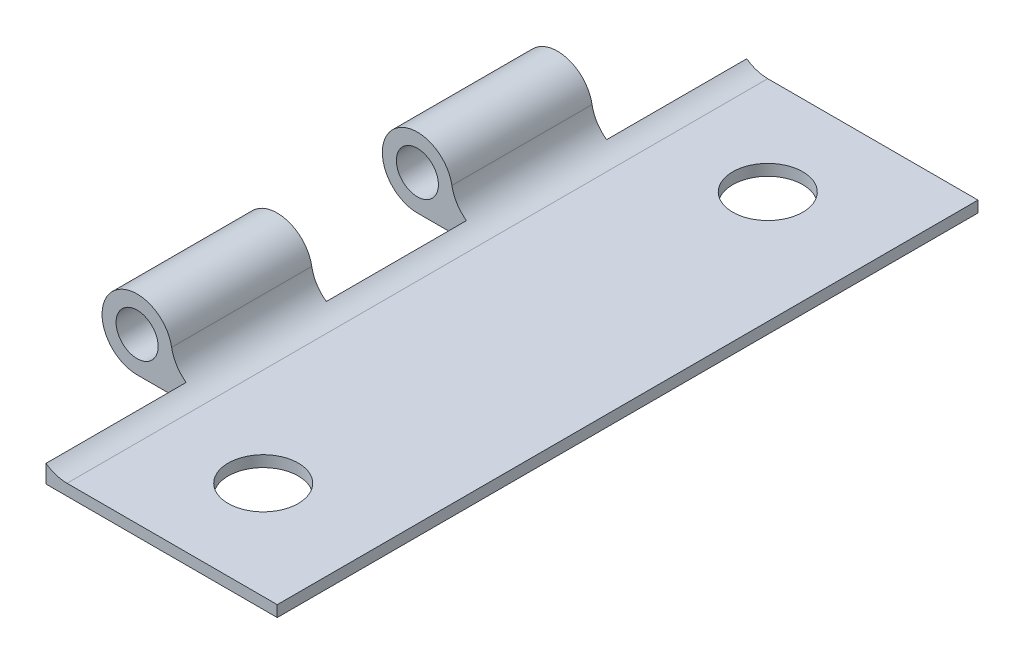
ISO-10303-21;
HEADER;
FILE_DESCRIPTION(('STEP AP214'),'2;1');
FILE_NAME('part.step','',(''),(''),'','','');
FILE_SCHEMA(('AUTOMOTIVE_DESIGN { 1 0 10303 214 1 1 1 1 }'));
ENDSEC;
DATA;
#1=APPLICATION_CONTEXT('core data for automotive mechanical design processes');
#2=APPLICATION_PROTOCOL_DEFINITION('international standard','automotive_design',2000,#1);
#3=PRODUCT_CONTEXT('',#1,'mechanical');
#4=PRODUCT('Part','Part','',(#3));
#5=PRODUCT_RELATED_PRODUCT_CATEGORY('part','',(#4));
#6=PRODUCT_DEFINITION_FORMATION('','',#4);
#7=PRODUCT_DEFINITION_CONTEXT('part definition',#1,'design');
#8=PRODUCT_DEFINITION('design','',#6,#7);
#9=PRODUCT_DEFINITION_SHAPE('','',#8);
#10=(LENGTH_UNIT() NAMED_UNIT(*) SI_UNIT(.MILLI.,.METRE.));
#11=(NAMED_UNIT(*) PLANE_ANGLE_UNIT() SI_UNIT($,.RADIAN.));
#12=(NAMED_UNIT(*) SI_UNIT($,.STERADIAN.) SOLID_ANGLE_UNIT());
#13=UNCERTAINTY_MEASURE_WITH_UNIT(LENGTH_MEASURE(1.E-05),#10,'distance_accuracy_value','');
#14=(GEOMETRIC_REPRESENTATION_CONTEXT(3) GLOBAL_UNCERTAINTY_ASSIGNED_CONTEXT((#13)) GLOBAL_UNIT_ASSIGNED_CONTEXT((#10,
#11,#12)) REPRESENTATION_CONTEXT('',''));
#15=CARTESIAN_POINT('',(0.,0.,0.));
#16=DIRECTION('',(0.,0.,1.));
#17=DIRECTION('',(1.,0.,0.));
#18=AXIS2_PLACEMENT_3D('',#15,#16,#17);
#19=CARTESIAN_POINT('',(-20.,2.50000000000001,50.));
#20=DIRECTION('',(0.,0.,-1.));
#21=DIRECTION('',(-1.,0.,0.));
#22=AXIS2_PLACEMENT_3D('',#19,#20,#21);
#23=CYLINDRICAL_SURFACE('',#22,2.5);
#24=DIRECTION('',(0.,0.,-1.));
#25=VECTOR('',#24,1.);
#26=CARTESIAN_POINT('',(-20.,0.,50.));
#27=LINE('',#26,#25);
#28=CARTESIAN_POINT('',(-20.,0.,20.));
#29=VERTEX_POINT('',#28);
#30=CARTESIAN_POINT('',(-20.,0.,10.));
#31=VERTEX_POINT('',#30);
#32=EDGE_CURVE('E155',#29,#31,#27,.T.);
#33=ORIENTED_EDGE('',*,*,#32,.F.);
#34=CARTESIAN_POINT('',(-20.,2.50000000000001,20.));
#35=DIRECTION('',(0.,0.,-1.));
#36=DIRECTION('',(-1.,0.,0.));
#37=AXIS2_PLACEMENT_3D('',#34,#35,#36);
#38=CIRCLE('',#37,2.5);
#39=CARTESIAN_POINT('',(-17.5375234521576,2.93151969981239,20.));
#40=VERTEX_POINT('',#39);
#41=EDGE_CURVE('E209',#29,#40,#38,.T.);
#42=ORIENTED_EDGE('',*,*,#41,.T.);
#43=DIRECTION('',(0.,0.,-1.));
#44=VECTOR('',#43,1.);
#45=CARTESIAN_POINT('',(-17.5375234521576,2.93151969981239,50.));
#46=LINE('',#45,#44);
#47=CARTESIAN_POINT('',(-17.5375234521576,2.93151969981239,10.));
#48=VERTEX_POINT('',#47);
#49=EDGE_CURVE('E176',#40,#48,#46,.T.);
#50=ORIENTED_EDGE('',*,*,#49,.T.);
#51=CARTESIAN_POINT('',(-20.,2.50000000000001,10.));
#52=DIRECTION('',(0.,0.,1.));
#53=DIRECTION('',(1.,0.,0.));
#54=AXIS2_PLACEMENT_3D('',#51,#52,#53);
#55=CIRCLE('',#54,2.5);
#56=EDGE_CURVE('E185',#48,#31,#55,.T.);
#57=ORIENTED_EDGE('',*,*,#56,.T.);
#58=EDGE_LOOP('',(#33,#42,#50,#57));
#59=FACE_BOUND('',#58,.T.);
#60=ADVANCED_FACE('F33',(#59),#23,.T.);
#61=CARTESIAN_POINT('',(-20.,2.50000000000001,50.));
#62=DIRECTION('',(0.,0.,-1.));
#63=DIRECTION('',(-1.,0.,0.));
#64=AXIS2_PLACEMENT_3D('',#61,#62,#63);
#65=PLANE('',#64);
#66=CARTESIAN_POINT('',(-15.,3.37619047619047,50.));
#67=DIRECTION('',(0.,0.,-1.));
#68=DIRECTION('',(1.,0.,0.));
#69=AXIS2_PLACEMENT_3D('',#66,#67,#68);
#70=CIRCLE('',#69,2.57619047619048);
#71=CARTESIAN_POINT('',(-15.,0.799999999999998,50.));
#72=VERTEX_POINT('',#71);
#73=CARTESIAN_POINT('',(-16.5,1.28173174668194,50.));
#74=VERTEX_POINT('',#73);
#75=EDGE_CURVE('E147',#72,#74,#70,.T.);
#76=ORIENTED_EDGE('',*,*,#75,.T.);
#77=DIRECTION('',(0.,-1.,0.));
#78=VECTOR('',#77,1.);
#79=CARTESIAN_POINT('',(-16.5,5.00000000000001,50.));
#80=LINE('',#79,#78);
#81=CARTESIAN_POINT('',(-16.5,0.,50.));
#82=VERTEX_POINT('',#81);
#83=EDGE_CURVE('E134',#74,#82,#80,.T.);
#84=ORIENTED_EDGE('',*,*,#83,.T.);
#85=DIRECTION('',(1.,0.,0.));
#86=VECTOR('',#85,1.);
#87=CARTESIAN_POINT('',(0.,0.,50.));
#88=LINE('',#87,#86);
#89=CARTESIAN_POINT('',(0.,0.,50.));
#90=VERTEX_POINT('',#89);
#91=EDGE_CURVE('E144',#82,#90,#88,.T.);
#92=ORIENTED_EDGE('',*,*,#91,.T.);
#93=DIRECTION('',(0.,1.,0.));
#94=VECTOR('',#93,1.);
#95=CARTESIAN_POINT('',(0.,0.799999999999994,50.));
#96=LINE('',#95,#94);
#97=CARTESIAN_POINT('',(0.,0.799999999999994,50.));
#98=VERTEX_POINT('',#97);
#99=EDGE_CURVE('E171',#90,#98,#96,.T.);
#100=ORIENTED_EDGE('',*,*,#99,.T.);
#101=DIRECTION('',(-1.,0.,0.));
#102=VECTOR('',#101,1.);
#103=CARTESIAN_POINT('',(-15.,0.799999999999998,50.));
#104=LINE('',#103,#102);
#105=EDGE_CURVE('E157',#98,#72,#104,.T.);
#106=ORIENTED_EDGE('',*,*,#105,.T.);
#107=EDGE_LOOP('',(#76,#84,#92,#100,#106));
#108=FACE_BOUND('',#107,.T.);
#109=ADVANCED_FACE('F142',(#108),#65,.F.);
#110=CARTESIAN_POINT('',(-20.,2.50000000000001,0.));
#111=DIRECTION('',(0.,0.,-1.));
#112=DIRECTION('',(-1.,0.,0.));
#113=AXIS2_PLACEMENT_3D('',#110,#111,#112);
#114=PLANE('',#113);
#115=DIRECTION('',(0.,-1.,0.));
#116=VECTOR('',#115,1.);
#117=CARTESIAN_POINT('',(-16.5,5.00000000000001,0.));
#118=LINE('',#117,#116);
#119=CARTESIAN_POINT('',(-16.5,1.28173174668194,0.));
#120=VERTEX_POINT('',#119);
#121=CARTESIAN_POINT('',(-16.5,0.,0.));
#122=VERTEX_POINT('',#121);
#123=EDGE_CURVE('E261',#120,#122,#118,.T.);
#124=ORIENTED_EDGE('',*,*,#123,.F.);
#125=CARTESIAN_POINT('',(-15.,3.37619047619047,0.));
#126=DIRECTION('',(0.,0.,-1.));
#127=DIRECTION('',(1.,0.,0.));
#128=AXIS2_PLACEMENT_3D('',#125,#126,#127);
#129=CIRCLE('',#128,2.57619047619048);
#130=CARTESIAN_POINT('',(-15.,0.799999999999998,0.));
#131=VERTEX_POINT('',#130);
#132=EDGE_CURVE('E167',#131,#120,#129,.T.);
#133=ORIENTED_EDGE('',*,*,#132,.F.);
#134=DIRECTION('',(-1.,0.,0.));
#135=VECTOR('',#134,1.);
#136=CARTESIAN_POINT('',(-15.,0.799999999999998,0.));
#137=LINE('',#136,#135);
#138=CARTESIAN_POINT('',(0.,0.799999999999994,0.));
#139=VERTEX_POINT('',#138);
#140=EDGE_CURVE('E164',#139,#131,#137,.T.);
#141=ORIENTED_EDGE('',*,*,#140,.F.);
#142=DIRECTION('',(0.,1.,0.));
#143=VECTOR('',#142,1.);
#144=CARTESIAN_POINT('',(0.,0.799999999999994,0.));
#145=LINE('',#144,#143);
#146=CARTESIAN_POINT('',(0.,0.,0.));
#147=VERTEX_POINT('',#146);
#148=EDGE_CURVE('E161',#147,#139,#145,.T.);
#149=ORIENTED_EDGE('',*,*,#148,.F.);
#150=DIRECTION('',(1.,0.,0.));
#151=VECTOR('',#150,1.);
#152=CARTESIAN_POINT('',(0.,0.,0.));
#153=LINE('',#152,#151);
#154=EDGE_CURVE('E170',#122,#147,#153,.T.);
#155=ORIENTED_EDGE('',*,*,#154,.F.);
#156=EDGE_LOOP('',(#124,#133,#141,#149,#155));
#157=FACE_BOUND('',#156,.T.);
#158=ADVANCED_FACE('F302',(#157),#114,.T.);
#159=CARTESIAN_POINT('',(0.,0.799999999999994,50.));
#160=DIRECTION('',(-1.,0.,0.));
#161=DIRECTION('',(0.,-1.,0.));
#162=AXIS2_PLACEMENT_3D('',#159,#160,#161);
#163=PLANE('',#162);
#164=ORIENTED_EDGE('',*,*,#148,.T.);
#165=DIRECTION('',(0.,0.,-1.));
#166=VECTOR('',#165,1.);
#167=CARTESIAN_POINT('',(0.,0.799999999999994,50.));
#168=LINE('',#167,#166);
#169=EDGE_CURVE('E11',#98,#139,#168,.T.);
#170=ORIENTED_EDGE('',*,*,#169,.F.);
#171=ORIENTED_EDGE('',*,*,#99,.F.);
#172=DIRECTION('',(0.,0.,-1.));
#173=VECTOR('',#172,1.);
#174=CARTESIAN_POINT('',(0.,0.,50.));
#175=LINE('',#174,#173);
#176=EDGE_CURVE('E152',#90,#147,#175,.T.);
#177=ORIENTED_EDGE('',*,*,#176,.T.);
#178=EDGE_LOOP('',(#164,#170,#171,#177));
#179=FACE_BOUND('',#178,.T.);
#180=ADVANCED_FACE('F35',(#179),#163,.F.);
#181=CARTESIAN_POINT('',(-15.,0.799999999999998,50.));
#182=DIRECTION('',(0.,-1.,0.));
#183=DIRECTION('',(1.,0.,0.));
#184=AXIS2_PLACEMENT_3D('',#181,#182,#183);
#185=PLANE('',#184);
#186=CARTESIAN_POINT('',(-8.,0.799999999999996,43.));
#187=DIRECTION('',(0.,-1.,0.));
#188=DIRECTION('',(1.,0.,0.));
#189=AXIS2_PLACEMENT_3D('',#186,#187,#188);
#190=CIRCLE('',#189,2.5);
#191=CARTESIAN_POINT('',(-5.5,0.799999999999995,43.));
#192=VERTEX_POINT('',#191);
#193=EDGE_CURVE('E165',#192,#192,#190,.T.);
#194=ORIENTED_EDGE('',*,*,#193,.T.);
#195=EDGE_LOOP('',(#194));
#196=FACE_BOUND('',#195,.T.);
#197=CARTESIAN_POINT('',(-7.99999999999999,0.799999999999996,7.));
#198=DIRECTION('',(0.,-1.,0.));
#199=DIRECTION('',(1.,0.,0.));
#200=AXIS2_PLACEMENT_3D('',#197,#198,#199);
#201=CIRCLE('',#200,2.5);
#202=CARTESIAN_POINT('',(-5.49999999999999,0.799999999999995,7.));
#203=VERTEX_POINT('',#202);
#204=EDGE_CURVE('E218',#203,#203,#201,.T.);
#205=ORIENTED_EDGE('',*,*,#204,.T.);
#206=EDGE_LOOP('',(#205));
#207=FACE_BOUND('',#206,.T.);
#208=ORIENTED_EDGE('',*,*,#140,.T.);
#209=DIRECTION('',(0.,0.,-1.));
#210=VECTOR('',#209,1.);
#211=CARTESIAN_POINT('',(-15.,0.799999999999998,50.));
#212=LINE('',#211,#210);
#213=EDGE_CURVE('E42',#72,#131,#212,.T.);
#214=ORIENTED_EDGE('',*,*,#213,.F.);
#215=ORIENTED_EDGE('',*,*,#105,.F.);
#216=ORIENTED_EDGE('',*,*,#169,.T.);
#217=EDGE_LOOP('',(#208,#214,#215,#216));
#218=FACE_BOUND('',#217,.T.);
#219=ADVANCED_FACE('F231',(#196,#207,#218),#185,.F.);
#220=CARTESIAN_POINT('',(-15.,3.37619047619047,50.));
#221=DIRECTION('',(0.,0.,-1.));
#222=DIRECTION('',(-1.,0.,0.));
#223=AXIS2_PLACEMENT_3D('',#220,#221,#222);
#224=CYLINDRICAL_SURFACE('',#223,2.57619047619048);
#225=ORIENTED_EDGE('',*,*,#49,.F.);
#226=CARTESIAN_POINT('',(-15.,3.37619047619047,20.));
#227=DIRECTION('',(0.,0.,-1.));
#228=DIRECTION('',(-1.,0.,0.));
#229=AXIS2_PLACEMENT_3D('',#226,#227,#228);
#230=CIRCLE('',#229,2.57619047619048);
#231=CARTESIAN_POINT('',(-16.5,1.28173174668194,20.));
#232=VERTEX_POINT('',#231);
#233=EDGE_CURVE('E212',#40,#232,#230,.F.);
#234=ORIENTED_EDGE('',*,*,#233,.T.);
#235=DIRECTION('',(0.,0.,-1.));
#236=VECTOR('',#235,1.);
#237=CARTESIAN_POINT('',(-16.5,1.28173174668194,50.));
#238=LINE('',#237,#236);
#239=CARTESIAN_POINT('',(-16.5,1.28173174668194,30.));
#240=VERTEX_POINT('',#239);
#241=EDGE_CURVE('E223',#232,#240,#238,.F.);
#242=ORIENTED_EDGE('',*,*,#241,.T.);
#243=CARTESIAN_POINT('',(-15.,3.37619047619047,30.));
#244=DIRECTION('',(0.,0.,1.));
#245=DIRECTION('',(1.,0.,0.));
#246=AXIS2_PLACEMENT_3D('',#243,#244,#245);
#247=CIRCLE('',#246,2.57619047619048);
#248=CARTESIAN_POINT('',(-17.5375234521576,2.93151969981239,30.));
#249=VERTEX_POINT('',#248);
#250=EDGE_CURVE('E197',#240,#249,#247,.F.);
#251=ORIENTED_EDGE('',*,*,#250,.T.);
#252=CARTESIAN_POINT('',(-17.5375234521576,2.93151969981239,40.));
#253=VERTEX_POINT('',#252);
#254=EDGE_CURVE('E179',#253,#249,#46,.T.);
#255=ORIENTED_EDGE('',*,*,#254,.F.);
#256=CARTESIAN_POINT('',(-15.,3.37619047619047,40.));
#257=DIRECTION('',(0.,0.,-1.));
#258=DIRECTION('',(-1.,0.,0.));
#259=AXIS2_PLACEMENT_3D('',#256,#257,#258);
#260=CIRCLE('',#259,2.57619047619048);
#261=CARTESIAN_POINT('',(-16.5,1.28173174668194,40.));
#262=VERTEX_POINT('',#261);
#263=EDGE_CURVE('E194',#253,#262,#260,.F.);
#264=ORIENTED_EDGE('',*,*,#263,.T.);
#265=DIRECTION('',(0.,0.,-1.));
#266=VECTOR('',#265,1.);
#267=CARTESIAN_POINT('',(-16.5,1.28173174668194,50.));
#268=LINE('',#267,#266);
#269=EDGE_CURVE('E221',#262,#74,#268,.F.);
#270=ORIENTED_EDGE('',*,*,#269,.T.);
#271=ORIENTED_EDGE('',*,*,#75,.F.);
#272=ORIENTED_EDGE('',*,*,#213,.T.);
#273=ORIENTED_EDGE('',*,*,#132,.T.);
#274=DIRECTION('',(0.,0.,-1.));
#275=VECTOR('',#274,1.);
#276=CARTESIAN_POINT('',(-16.5,1.28173174668194,50.));
#277=LINE('',#276,#275);
#278=CARTESIAN_POINT('',(-16.5,1.28173174668194,10.));
#279=VERTEX_POINT('',#278);
#280=EDGE_CURVE('E215',#120,#279,#277,.F.);
#281=ORIENTED_EDGE('',*,*,#280,.T.);
#282=CARTESIAN_POINT('',(-15.,3.37619047619047,10.));
#283=DIRECTION('',(0.,0.,1.));
#284=DIRECTION('',(1.,0.,0.));
#285=AXIS2_PLACEMENT_3D('',#282,#283,#284);
#286=CIRCLE('',#285,2.57619047619048);
#287=EDGE_CURVE('E190',#279,#48,#286,.F.);
#288=ORIENTED_EDGE('',*,*,#287,.T.);
#289=EDGE_LOOP('',(#225,#234,#242,#251,#255,#264,#270,#271,#272,#273,#281,#288));
#290=FACE_BOUND('',#289,.T.);
#291=ADVANCED_FACE('F234',(#290),#224,.F.);
#292=ORIENTED_EDGE('',*,*,#254,.T.);
#293=CARTESIAN_POINT('',(-20.,2.50000000000001,30.));
#294=DIRECTION('',(0.,0.,1.));
#295=DIRECTION('',(1.,0.,0.));
#296=AXIS2_PLACEMENT_3D('',#293,#294,#295);
#297=CIRCLE('',#296,2.5);
#298=CARTESIAN_POINT('',(-20.,0.,30.));
#299=VERTEX_POINT('',#298);
#300=EDGE_CURVE('E193',#249,#299,#297,.T.);
#301=ORIENTED_EDGE('',*,*,#300,.T.);
#302=CARTESIAN_POINT('',(-20.,0.,40.));
#303=VERTEX_POINT('',#302);
#304=EDGE_CURVE('E175',#303,#299,#27,.T.);
#305=ORIENTED_EDGE('',*,*,#304,.F.);
#306=CARTESIAN_POINT('',(-20.,2.50000000000001,40.));
#307=DIRECTION('',(0.,0.,-1.));
#308=DIRECTION('',(-1.,0.,0.));
#309=AXIS2_PLACEMENT_3D('',#306,#307,#308);
#310=CIRCLE('',#309,2.5);
#311=EDGE_CURVE('E189',#303,#253,#310,.T.);
#312=ORIENTED_EDGE('',*,*,#311,.T.);
#313=EDGE_LOOP('',(#292,#301,#305,#312));
#314=FACE_BOUND('',#313,.T.);
#315=ADVANCED_FACE('F279',(#314),#23,.T.);
#316=CARTESIAN_POINT('',(0.,0.,50.));
#317=DIRECTION('',(0.,1.,0.));
#318=DIRECTION('',(-1.,0.,0.));
#319=AXIS2_PLACEMENT_3D('',#316,#317,#318);
#320=PLANE('',#319);
#321=CARTESIAN_POINT('',(-8.,0.,43.));
#322=DIRECTION('',(0.,-1.,0.));
#323=DIRECTION('',(1.,0.,0.));
#324=AXIS2_PLACEMENT_3D('',#321,#322,#323);
#325=CIRCLE('',#324,2.5);
#326=CARTESIAN_POINT('',(-5.5,0.,43.));
#327=VERTEX_POINT('',#326);
#328=EDGE_CURVE('E241',#327,#327,#325,.T.);
#329=ORIENTED_EDGE('',*,*,#328,.F.);
#330=EDGE_LOOP('',(#329));
#331=FACE_BOUND('',#330,.T.);
#332=CARTESIAN_POINT('',(-7.99999999999999,0.,7.));
#333=DIRECTION('',(0.,-1.,0.));
#334=DIRECTION('',(-1.,0.,0.));
#335=AXIS2_PLACEMENT_3D('',#332,#333,#334);
#336=CIRCLE('',#335,2.5);
#337=CARTESIAN_POINT('',(-10.5,0.,7.));
#338=VERTEX_POINT('',#337);
#339=EDGE_CURVE('E238',#338,#338,#336,.T.);
#340=ORIENTED_EDGE('',*,*,#339,.F.);
#341=EDGE_LOOP('',(#340));
#342=FACE_BOUND('',#341,.T.);
#343=DIRECTION('',(0.,0.,1.));
#344=VECTOR('',#343,1.);
#345=CARTESIAN_POINT('',(-16.5,0.,20.));
#346=LINE('',#345,#344);
#347=CARTESIAN_POINT('',(-16.5,0.,20.));
#348=VERTEX_POINT('',#347);
#349=CARTESIAN_POINT('',(-16.5,0.,30.));
#350=VERTEX_POINT('',#349);
#351=EDGE_CURVE('E247',#348,#350,#346,.T.);
#352=ORIENTED_EDGE('',*,*,#351,.F.);
#353=DIRECTION('',(1.,0.,0.));
#354=VECTOR('',#353,1.);
#355=CARTESIAN_POINT('',(-22.5,0.,20.));
#356=LINE('',#355,#354);
#357=EDGE_CURVE('E50',#29,#348,#356,.T.);
#358=ORIENTED_EDGE('',*,*,#357,.F.);
#359=ORIENTED_EDGE('',*,*,#32,.T.);
#360=DIRECTION('',(-1.,0.,0.));
#361=VECTOR('',#360,1.);
#362=CARTESIAN_POINT('',(-22.5,0.,10.));
#363=LINE('',#362,#361);
#364=CARTESIAN_POINT('',(-16.5,0.,10.));
#365=VERTEX_POINT('',#364);
#366=EDGE_CURVE('E258',#365,#31,#363,.T.);
#367=ORIENTED_EDGE('',*,*,#366,.F.);
#368=DIRECTION('',(0.,0.,1.));
#369=VECTOR('',#368,1.);
#370=CARTESIAN_POINT('',(-16.5,0.,0.));
#371=LINE('',#370,#369);
#372=EDGE_CURVE('E244',#122,#365,#371,.T.);
#373=ORIENTED_EDGE('',*,*,#372,.F.);
#374=ORIENTED_EDGE('',*,*,#154,.T.);
#375=ORIENTED_EDGE('',*,*,#176,.F.);
#376=ORIENTED_EDGE('',*,*,#91,.F.);
#377=DIRECTION('',(0.,0.,1.));
#378=VECTOR('',#377,1.);
#379=CARTESIAN_POINT('',(-16.5,0.,40.));
#380=LINE('',#379,#378);
#381=CARTESIAN_POINT('',(-16.5,0.,40.));
#382=VERTEX_POINT('',#381);
#383=EDGE_CURVE('E131',#382,#82,#380,.T.);
#384=ORIENTED_EDGE('',*,*,#383,.F.);
#385=DIRECTION('',(1.,0.,0.));
#386=VECTOR('',#385,1.);
#387=CARTESIAN_POINT('',(-22.5,0.,40.));
#388=LINE('',#387,#386);
#389=EDGE_CURVE('E58',#303,#382,#388,.T.);
#390=ORIENTED_EDGE('',*,*,#389,.F.);
#391=ORIENTED_EDGE('',*,*,#304,.T.);
#392=DIRECTION('',(-1.,0.,0.));
#393=VECTOR('',#392,1.);
#394=CARTESIAN_POINT('',(-22.5,0.,30.));
#395=LINE('',#394,#393);
#396=EDGE_CURVE('E250',#350,#299,#395,.T.);
#397=ORIENTED_EDGE('',*,*,#396,.F.);
#398=EDGE_LOOP('',(#352,#358,#359,#367,#373,#374,#375,#376,#384,#390,#391,#397));
#399=FACE_BOUND('',#398,.T.);
#400=ADVANCED_FACE('F150',(#331,#342,#399),#320,.F.);
#401=CARTESIAN_POINT('',(-16.5,5.00000000000001,0.));
#402=DIRECTION('',(1.,0.,0.));
#403=DIRECTION('',(0.,1.,0.));
#404=AXIS2_PLACEMENT_3D('',#401,#402,#403);
#405=PLANE('',#404);
#406=ORIENTED_EDGE('',*,*,#123,.T.);
#407=ORIENTED_EDGE('',*,*,#372,.T.);
#408=DIRECTION('',(0.,-1.,0.));
#409=VECTOR('',#408,1.);
#410=CARTESIAN_POINT('',(-16.5,5.00000000000001,10.));
#411=LINE('',#410,#409);
#412=EDGE_CURVE('E186',#279,#365,#411,.T.);
#413=ORIENTED_EDGE('',*,*,#412,.F.);
#414=ORIENTED_EDGE('',*,*,#280,.F.);
#415=EDGE_LOOP('',(#406,#407,#413,#414));
#416=FACE_BOUND('',#415,.T.);
#417=ADVANCED_FACE('F311',(#416),#405,.F.);
#418=CARTESIAN_POINT('',(-22.5,5.00000000000001,10.));
#419=DIRECTION('',(0.,0.,1.));
#420=DIRECTION('',(1.,0.,0.));
#421=AXIS2_PLACEMENT_3D('',#418,#419,#420);
#422=PLANE('',#421);
#423=CARTESIAN_POINT('',(-20.,2.50000000000001,10.));
#424=DIRECTION('',(0.,0.,1.));
#425=DIRECTION('',(1.,0.,0.));
#426=AXIS2_PLACEMENT_3D('',#423,#424,#425);
#427=CIRCLE('',#426,1.5);
#428=CARTESIAN_POINT('',(-18.5,2.50000000000001,10.));
#429=VERTEX_POINT('',#428);
#430=EDGE_CURVE('E182',#429,#429,#427,.T.);
#431=ORIENTED_EDGE('',*,*,#430,.T.);
#432=EDGE_LOOP('',(#431));
#433=FACE_BOUND('',#432,.T.);
#434=ORIENTED_EDGE('',*,*,#56,.F.);
#435=ORIENTED_EDGE('',*,*,#287,.F.);
#436=ORIENTED_EDGE('',*,*,#412,.T.);
#437=ORIENTED_EDGE('',*,*,#366,.T.);
#438=EDGE_LOOP('',(#434,#435,#436,#437));
#439=FACE_BOUND('',#438,.T.);
#440=ADVANCED_FACE('F340',(#433,#439),#422,.F.);
#441=CARTESIAN_POINT('',(-16.5,5.00000000000001,40.));
#442=DIRECTION('',(1.,0.,0.));
#443=DIRECTION('',(0.,1.,0.));
#444=AXIS2_PLACEMENT_3D('',#441,#442,#443);
#445=PLANE('',#444);
#446=DIRECTION('',(0.,-1.,0.));
#447=VECTOR('',#446,1.);
#448=CARTESIAN_POINT('',(-16.5,5.00000000000001,40.));
#449=LINE('',#448,#447);
#450=EDGE_CURVE('E136',#262,#382,#449,.T.);
#451=ORIENTED_EDGE('',*,*,#450,.T.);
#452=ORIENTED_EDGE('',*,*,#383,.T.);
#453=ORIENTED_EDGE('',*,*,#83,.F.);
#454=ORIENTED_EDGE('',*,*,#269,.F.);
#455=EDGE_LOOP('',(#451,#452,#453,#454));
#456=FACE_BOUND('',#455,.T.);
#457=ADVANCED_FACE('F133',(#456),#445,.F.);
#458=CARTESIAN_POINT('',(-22.5,5.00000000000001,40.));
#459=DIRECTION('',(0.,0.,-1.));
#460=DIRECTION('',(-1.,0.,0.));
#461=AXIS2_PLACEMENT_3D('',#458,#459,#460);
#462=PLANE('',#461);
#463=CARTESIAN_POINT('',(-20.,2.50000000000001,40.));
#464=DIRECTION('',(0.,0.,-1.));
#465=DIRECTION('',(-1.,0.,0.));
#466=AXIS2_PLACEMENT_3D('',#463,#464,#465);
#467=CIRCLE('',#466,1.5);
#468=CARTESIAN_POINT('',(-21.5,2.50000000000001,40.));
#469=VERTEX_POINT('',#468);
#470=EDGE_CURVE('E187',#469,#469,#467,.T.);
#471=ORIENTED_EDGE('',*,*,#470,.T.);
#472=EDGE_LOOP('',(#471));
#473=FACE_BOUND('',#472,.T.);
#474=ORIENTED_EDGE('',*,*,#311,.F.);
#475=ORIENTED_EDGE('',*,*,#389,.T.);
#476=ORIENTED_EDGE('',*,*,#450,.F.);
#477=ORIENTED_EDGE('',*,*,#263,.F.);
#478=EDGE_LOOP('',(#474,#475,#476,#477));
#479=FACE_BOUND('',#478,.T.);
#480=ADVANCED_FACE('F235',(#473,#479),#462,.F.);
#481=CARTESIAN_POINT('',(-16.5,5.00000000000001,20.));
#482=DIRECTION('',(1.,0.,0.));
#483=DIRECTION('',(0.,1.,0.));
#484=AXIS2_PLACEMENT_3D('',#481,#482,#483);
#485=PLANE('',#484);
#486=DIRECTION('',(0.,-1.,0.));
#487=VECTOR('',#486,1.);
#488=CARTESIAN_POINT('',(-16.5,5.00000000000001,20.));
#489=LINE('',#488,#487);
#490=EDGE_CURVE('E253',#232,#348,#489,.T.);
#491=ORIENTED_EDGE('',*,*,#490,.T.);
#492=ORIENTED_EDGE('',*,*,#351,.T.);
#493=DIRECTION('',(0.,-1.,0.));
#494=VECTOR('',#493,1.);
#495=CARTESIAN_POINT('',(-16.5,5.00000000000001,30.));
#496=LINE('',#495,#494);
#497=EDGE_CURVE('E245',#240,#350,#496,.T.);
#498=ORIENTED_EDGE('',*,*,#497,.F.);
#499=ORIENTED_EDGE('',*,*,#241,.F.);
#500=EDGE_LOOP('',(#491,#492,#498,#499));
#501=FACE_BOUND('',#500,.T.);
#502=ADVANCED_FACE('F275',(#501),#485,.F.);
#503=CARTESIAN_POINT('',(-22.5,5.00000000000001,20.));
#504=DIRECTION('',(0.,0.,-1.));
#505=DIRECTION('',(-1.,0.,0.));
#506=AXIS2_PLACEMENT_3D('',#503,#504,#505);
#507=PLANE('',#506);
#508=CARTESIAN_POINT('',(-20.,2.50000000000001,20.));
#509=DIRECTION('',(0.,0.,-1.));
#510=DIRECTION('',(-1.,0.,0.));
#511=AXIS2_PLACEMENT_3D('',#508,#509,#510);
#512=CIRCLE('',#511,1.5);
#513=CARTESIAN_POINT('',(-21.5,2.50000000000001,20.));
#514=VERTEX_POINT('',#513);
#515=EDGE_CURVE('E37',#514,#514,#512,.T.);
#516=ORIENTED_EDGE('',*,*,#515,.T.);
#517=EDGE_LOOP('',(#516));
#518=FACE_BOUND('',#517,.T.);
#519=ORIENTED_EDGE('',*,*,#41,.F.);
#520=ORIENTED_EDGE('',*,*,#357,.T.);
#521=ORIENTED_EDGE('',*,*,#490,.F.);
#522=ORIENTED_EDGE('',*,*,#233,.F.);
#523=EDGE_LOOP('',(#519,#520,#521,#522));
#524=FACE_BOUND('',#523,.T.);
#525=ADVANCED_FACE('F269',(#518,#524),#507,.F.);
#526=CARTESIAN_POINT('',(-22.5,5.00000000000001,30.));
#527=DIRECTION('',(0.,0.,1.));
#528=DIRECTION('',(1.,0.,0.));
#529=AXIS2_PLACEMENT_3D('',#526,#527,#528);
#530=PLANE('',#529);
#531=CARTESIAN_POINT('',(-20.,2.50000000000001,30.));
#532=DIRECTION('',(0.,0.,1.));
#533=DIRECTION('',(1.,0.,0.));
#534=AXIS2_PLACEMENT_3D('',#531,#532,#533);
#535=CIRCLE('',#534,1.5);
#536=CARTESIAN_POINT('',(-18.5,2.50000000000001,30.));
#537=VERTEX_POINT('',#536);
#538=EDGE_CURVE('E191',#537,#537,#535,.T.);
#539=ORIENTED_EDGE('',*,*,#538,.T.);
#540=EDGE_LOOP('',(#539));
#541=FACE_BOUND('',#540,.T.);
#542=ORIENTED_EDGE('',*,*,#300,.F.);
#543=ORIENTED_EDGE('',*,*,#250,.F.);
#544=ORIENTED_EDGE('',*,*,#497,.T.);
#545=ORIENTED_EDGE('',*,*,#396,.T.);
#546=EDGE_LOOP('',(#542,#543,#544,#545));
#547=FACE_BOUND('',#546,.T.);
#548=ADVANCED_FACE('F282',(#541,#547),#530,.F.);
#549=CARTESIAN_POINT('',(-7.99999999999999,5.00000000000002,7.));
#550=DIRECTION('',(0.,-1.,0.));
#551=DIRECTION('',(1.,0.,0.));
#552=AXIS2_PLACEMENT_3D('',#549,#550,#551);
#553=CYLINDRICAL_SURFACE('',#552,2.5);
#554=ORIENTED_EDGE('',*,*,#339,.T.);
#555=EDGE_LOOP('',(#554));
#556=FACE_BOUND('',#555,.T.);
#557=ORIENTED_EDGE('',*,*,#204,.F.);
#558=EDGE_LOOP('',(#557));
#559=FACE_BOUND('',#558,.T.);
#560=ADVANCED_FACE('F284',(#556,#559),#553,.F.);
#561=CARTESIAN_POINT('',(-8.,5.00000000000002,43.));
#562=DIRECTION('',(0.,-1.,0.));
#563=DIRECTION('',(1.,0.,0.));
#564=AXIS2_PLACEMENT_3D('',#561,#562,#563);
#565=CYLINDRICAL_SURFACE('',#564,2.5);
#566=ORIENTED_EDGE('',*,*,#328,.T.);
#567=EDGE_LOOP('',(#566));
#568=FACE_BOUND('',#567,.T.);
#569=ORIENTED_EDGE('',*,*,#193,.F.);
#570=EDGE_LOOP('',(#569));
#571=FACE_BOUND('',#570,.T.);
#572=ADVANCED_FACE('F290',(#568,#571),#565,.F.);
#573=CARTESIAN_POINT('',(-20.,2.50000000000001,50.));
#574=DIRECTION('',(0.,0.,-1.));
#575=DIRECTION('',(-1.,0.,0.));
#576=AXIS2_PLACEMENT_3D('',#573,#574,#575);
#577=CYLINDRICAL_SURFACE('',#576,1.5);
#578=ORIENTED_EDGE('',*,*,#515,.F.);
#579=EDGE_LOOP('',(#578));
#580=FACE_BOUND('',#579,.T.);
#581=ORIENTED_EDGE('',*,*,#430,.F.);
#582=EDGE_LOOP('',(#581));
#583=FACE_BOUND('',#582,.T.);
#584=ADVANCED_FACE('F327',(#580,#583),#577,.F.);
#585=ORIENTED_EDGE('',*,*,#538,.F.);
#586=EDGE_LOOP('',(#585));
#587=FACE_BOUND('',#586,.T.);
#588=ORIENTED_EDGE('',*,*,#470,.F.);
#589=EDGE_LOOP('',(#588));
#590=FACE_BOUND('',#589,.T.);
#591=ADVANCED_FACE('F332',(#587,#590),#577,.F.);
#592=CLOSED_SHELL('',(#60,#109,#158,#180,#219,#291,#315,#400,#417,#440,#457,#480,#502,#525,#548,
#560,#572,#584,#591));
#593=MANIFOLD_SOLID_BREP('B2',#592);
#594=ADVANCED_BREP_SHAPE_REPRESENTATION('',(#18,#593),#14);
#595=SHAPE_DEFINITION_REPRESENTATION(#9,#594);
ENDSEC;
END-ISO-10303-21;
